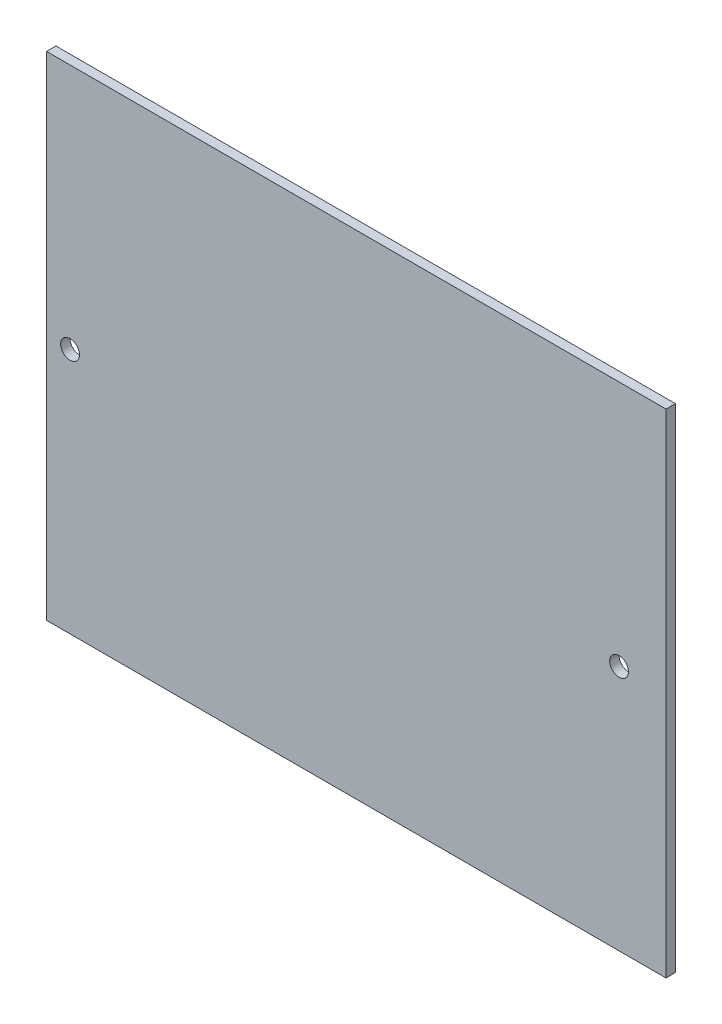
ISO-10303-21;
HEADER;
FILE_DESCRIPTION(('STEP AP214'),'2;1');
FILE_NAME('part.step','',(''),(''),'','','');
FILE_SCHEMA(('AUTOMOTIVE_DESIGN { 1 0 10303 214 1 1 1 1 }'));
ENDSEC;
DATA;
#1=APPLICATION_CONTEXT('core data for automotive mechanical design processes');
#2=APPLICATION_PROTOCOL_DEFINITION('international standard','automotive_design',2000,#1);
#3=PRODUCT_CONTEXT('',#1,'mechanical');
#4=PRODUCT('Part','Part','',(#3));
#5=PRODUCT_RELATED_PRODUCT_CATEGORY('part','',(#4));
#6=PRODUCT_DEFINITION_FORMATION('','',#4);
#7=PRODUCT_DEFINITION_CONTEXT('part definition',#1,'design');
#8=PRODUCT_DEFINITION('design','',#6,#7);
#9=PRODUCT_DEFINITION_SHAPE('','',#8);
#10=(LENGTH_UNIT() NAMED_UNIT(*) SI_UNIT(.MILLI.,.METRE.));
#11=(NAMED_UNIT(*) PLANE_ANGLE_UNIT() SI_UNIT($,.RADIAN.));
#12=(NAMED_UNIT(*) SI_UNIT($,.STERADIAN.) SOLID_ANGLE_UNIT());
#13=UNCERTAINTY_MEASURE_WITH_UNIT(LENGTH_MEASURE(1.E-05),#10,'distance_accuracy_value','');
#14=(GEOMETRIC_REPRESENTATION_CONTEXT(3) GLOBAL_UNCERTAINTY_ASSIGNED_CONTEXT((#13)) GLOBAL_UNIT_ASSIGNED_CONTEXT((#10,
#11,#12)) REPRESENTATION_CONTEXT('',''));
#15=CARTESIAN_POINT('',(0.,0.,0.));
#16=DIRECTION('',(0.,0.,1.));
#17=DIRECTION('',(1.,0.,0.));
#18=AXIS2_PLACEMENT_3D('',#15,#16,#17);
#19=CARTESIAN_POINT('',(206.120120188516,-39.1421064558575,2.));
#20=DIRECTION('',(-1.,0.,0.));
#21=DIRECTION('',(0.,0.,1.));
#22=AXIS2_PLACEMENT_3D('',#19,#20,#21);
#23=PLANE('',#22);
#24=DIRECTION('',(0.,1.,0.));
#25=VECTOR('',#24,1.);
#26=CARTESIAN_POINT('',(206.120120188516,-39.1421064558575,0.));
#27=LINE('',#26,#25);
#28=CARTESIAN_POINT('',(206.120120188516,-39.1421064558575,0.));
#29=VERTEX_POINT('',#28);
#30=CARTESIAN_POINT('',(206.120120188516,65.8578935441425,0.));
#31=VERTEX_POINT('',#30);
#32=EDGE_CURVE('E95',#29,#31,#27,.T.);
#33=ORIENTED_EDGE('',*,*,#32,.T.);
#34=DIRECTION('',(0.,0.,-1.));
#35=VECTOR('',#34,1.);
#36=CARTESIAN_POINT('',(206.120120188516,65.8578935441425,2.));
#37=LINE('',#36,#35);
#38=CARTESIAN_POINT('',(206.120120188516,65.8578935441425,2.));
#39=VERTEX_POINT('',#38);
#40=EDGE_CURVE('E11',#39,#31,#37,.T.);
#41=ORIENTED_EDGE('',*,*,#40,.F.);
#42=DIRECTION('',(0.,1.,0.));
#43=VECTOR('',#42,1.);
#44=CARTESIAN_POINT('',(206.120120188516,-39.1421064558575,2.));
#45=LINE('',#44,#43);
#46=CARTESIAN_POINT('',(206.120120188516,-39.1421064558575,2.));
#47=VERTEX_POINT('',#46);
#48=EDGE_CURVE('E83',#47,#39,#45,.T.);
#49=ORIENTED_EDGE('',*,*,#48,.F.);
#50=DIRECTION('',(0.,0.,-1.));
#51=VECTOR('',#50,1.);
#52=CARTESIAN_POINT('',(206.120120188516,-39.1421064558575,2.));
#53=LINE('',#52,#51);
#54=EDGE_CURVE('E91',#47,#29,#53,.T.);
#55=ORIENTED_EDGE('',*,*,#54,.T.);
#56=EDGE_LOOP('',(#33,#41,#49,#55));
#57=FACE_BOUND('',#56,.T.);
#58=ADVANCED_FACE('F32',(#57),#23,.F.);
#59=CARTESIAN_POINT('',(206.120120188516,65.8578935441425,2.));
#60=DIRECTION('',(0.,-1.,0.));
#61=DIRECTION('',(1.,0.,0.));
#62=AXIS2_PLACEMENT_3D('',#59,#60,#61);
#63=PLANE('',#62);
#64=DIRECTION('',(-1.,0.,0.));
#65=VECTOR('',#64,1.);
#66=CARTESIAN_POINT('',(206.120120188516,65.8578935441425,0.));
#67=LINE('',#66,#65);
#68=CARTESIAN_POINT('',(74.1201201885163,65.8578935441425,0.));
#69=VERTEX_POINT('',#68);
#70=EDGE_CURVE('E87',#31,#69,#67,.T.);
#71=ORIENTED_EDGE('',*,*,#70,.T.);
#72=DIRECTION('',(0.,0.,-1.));
#73=VECTOR('',#72,1.);
#74=CARTESIAN_POINT('',(74.1201201885163,65.8578935441425,2.));
#75=LINE('',#74,#73);
#76=CARTESIAN_POINT('',(74.1201201885163,65.8578935441425,2.));
#77=VERTEX_POINT('',#76);
#78=EDGE_CURVE('E40',#77,#69,#75,.T.);
#79=ORIENTED_EDGE('',*,*,#78,.F.);
#80=DIRECTION('',(-1.,0.,0.));
#81=VECTOR('',#80,1.);
#82=CARTESIAN_POINT('',(206.120120188516,65.8578935441425,2.));
#83=LINE('',#82,#81);
#84=EDGE_CURVE('E78',#39,#77,#83,.T.);
#85=ORIENTED_EDGE('',*,*,#84,.F.);
#86=ORIENTED_EDGE('',*,*,#40,.T.);
#87=EDGE_LOOP('',(#71,#79,#85,#86));
#88=FACE_BOUND('',#87,.T.);
#89=ADVANCED_FACE('F86',(#88),#63,.F.);
#90=CARTESIAN_POINT('',(74.1201201885163,65.8578935441425,2.));
#91=DIRECTION('',(1.,0.,0.));
#92=DIRECTION('',(0.,0.,-1.));
#93=AXIS2_PLACEMENT_3D('',#90,#91,#92);
#94=PLANE('',#93);
#95=DIRECTION('',(0.,-1.,0.));
#96=VECTOR('',#95,1.);
#97=CARTESIAN_POINT('',(74.1201201885163,65.8578935441425,0.));
#98=LINE('',#97,#96);
#99=CARTESIAN_POINT('',(74.1201201885163,-39.1421064558575,0.));
#100=VERTEX_POINT('',#99);
#101=EDGE_CURVE('E65',#69,#100,#98,.T.);
#102=ORIENTED_EDGE('',*,*,#101,.T.);
#103=DIRECTION('',(0.,0.,-1.));
#104=VECTOR('',#103,1.);
#105=CARTESIAN_POINT('',(74.1201201885163,-39.1421064558575,2.));
#106=LINE('',#105,#104);
#107=CARTESIAN_POINT('',(74.1201201885163,-39.1421064558575,2.));
#108=VERTEX_POINT('',#107);
#109=EDGE_CURVE('E88',#108,#100,#106,.T.);
#110=ORIENTED_EDGE('',*,*,#109,.F.);
#111=DIRECTION('',(0.,-1.,0.));
#112=VECTOR('',#111,1.);
#113=CARTESIAN_POINT('',(74.1201201885163,65.8578935441425,2.));
#114=LINE('',#113,#112);
#115=EDGE_CURVE('E81',#77,#108,#114,.T.);
#116=ORIENTED_EDGE('',*,*,#115,.F.);
#117=ORIENTED_EDGE('',*,*,#78,.T.);
#118=EDGE_LOOP('',(#102,#110,#116,#117));
#119=FACE_BOUND('',#118,.T.);
#120=ADVANCED_FACE('F89',(#119),#94,.F.);
#121=CARTESIAN_POINT('',(74.1201201885163,-39.1421064558575,2.));
#122=DIRECTION('',(0.,1.,0.));
#123=DIRECTION('',(-1.,0.,0.));
#124=AXIS2_PLACEMENT_3D('',#121,#122,#123);
#125=PLANE('',#124);
#126=DIRECTION('',(1.,0.,0.));
#127=VECTOR('',#126,1.);
#128=CARTESIAN_POINT('',(74.1201201885163,-39.1421064558575,0.));
#129=LINE('',#128,#127);
#130=EDGE_CURVE('E71',#100,#29,#129,.T.);
#131=ORIENTED_EDGE('',*,*,#130,.T.);
#132=ORIENTED_EDGE('',*,*,#54,.F.);
#133=DIRECTION('',(1.,0.,0.));
#134=VECTOR('',#133,1.);
#135=CARTESIAN_POINT('',(74.1201201885163,-39.1421064558575,2.));
#136=LINE('',#135,#134);
#137=EDGE_CURVE('E48',#108,#47,#136,.T.);
#138=ORIENTED_EDGE('',*,*,#137,.F.);
#139=ORIENTED_EDGE('',*,*,#109,.T.);
#140=EDGE_LOOP('',(#131,#132,#138,#139));
#141=FACE_BOUND('',#140,.T.);
#142=ADVANCED_FACE('F103',(#141),#125,.F.);
#143=CARTESIAN_POINT('',(0.,0.,2.));
#144=DIRECTION('',(0.,0.,1.));
#145=DIRECTION('',(1.,0.,0.));
#146=AXIS2_PLACEMENT_3D('',#143,#144,#145);
#147=PLANE('',#146);
#148=CARTESIAN_POINT('',(79.1201201885163,13.3578935441425,2.));
#149=DIRECTION('',(0.,0.,1.));
#150=DIRECTION('',(1.,0.,0.));
#151=AXIS2_PLACEMENT_3D('',#148,#149,#150);
#152=CIRCLE('',#151,2.);
#153=CARTESIAN_POINT('',(81.1201201885163,13.3578935441425,2.));
#154=VERTEX_POINT('',#153);
#155=EDGE_CURVE('E114',#154,#154,#152,.T.);
#156=ORIENTED_EDGE('',*,*,#155,.F.);
#157=EDGE_LOOP('',(#156));
#158=FACE_BOUND('',#157,.T.);
#159=CARTESIAN_POINT('',(196.120120188516,13.3578935441425,2.));
#160=DIRECTION('',(0.,0.,1.));
#161=DIRECTION('',(1.,0.,0.));
#162=AXIS2_PLACEMENT_3D('',#159,#160,#161);
#163=CIRCLE('',#162,2.);
#164=CARTESIAN_POINT('',(198.120120188516,13.3578935441425,2.));
#165=VERTEX_POINT('',#164);
#166=EDGE_CURVE('E98',#165,#165,#163,.T.);
#167=ORIENTED_EDGE('',*,*,#166,.F.);
#168=EDGE_LOOP('',(#167));
#169=FACE_BOUND('',#168,.T.);
#170=ORIENTED_EDGE('',*,*,#48,.T.);
#171=ORIENTED_EDGE('',*,*,#84,.T.);
#172=ORIENTED_EDGE('',*,*,#115,.T.);
#173=ORIENTED_EDGE('',*,*,#137,.T.);
#174=EDGE_LOOP('',(#170,#171,#172,#173));
#175=FACE_BOUND('',#174,.T.);
#176=ADVANCED_FACE('F79',(#158,#169,#175),#147,.T.);
#177=CARTESIAN_POINT('',(0.,0.,0.));
#178=DIRECTION('',(0.,0.,1.));
#179=DIRECTION('',(1.,0.,0.));
#180=AXIS2_PLACEMENT_3D('',#177,#178,#179);
#181=PLANE('',#180);
#182=CARTESIAN_POINT('',(79.1201201885163,13.3578935441425,0.));
#183=DIRECTION('',(0.,0.,-1.));
#184=DIRECTION('',(-1.,0.,0.));
#185=AXIS2_PLACEMENT_3D('',#182,#183,#184);
#186=CIRCLE('',#185,2.);
#187=CARTESIAN_POINT('',(77.1201201885163,13.3578935441425,0.));
#188=VERTEX_POINT('',#187);
#189=EDGE_CURVE('E117',#188,#188,#186,.T.);
#190=ORIENTED_EDGE('',*,*,#189,.F.);
#191=EDGE_LOOP('',(#190));
#192=FACE_BOUND('',#191,.T.);
#193=CARTESIAN_POINT('',(196.120120188516,13.3578935441425,0.));
#194=DIRECTION('',(0.,0.,-1.));
#195=DIRECTION('',(-1.,0.,0.));
#196=AXIS2_PLACEMENT_3D('',#193,#194,#195);
#197=CIRCLE('',#196,2.);
#198=CARTESIAN_POINT('',(194.120120188516,13.3578935441425,0.));
#199=VERTEX_POINT('',#198);
#200=EDGE_CURVE('E111',#199,#199,#197,.T.);
#201=ORIENTED_EDGE('',*,*,#200,.F.);
#202=EDGE_LOOP('',(#201));
#203=FACE_BOUND('',#202,.T.);
#204=ORIENTED_EDGE('',*,*,#32,.F.);
#205=ORIENTED_EDGE('',*,*,#130,.F.);
#206=ORIENTED_EDGE('',*,*,#101,.F.);
#207=ORIENTED_EDGE('',*,*,#70,.F.);
#208=EDGE_LOOP('',(#204,#205,#206,#207));
#209=FACE_BOUND('',#208,.T.);
#210=ADVANCED_FACE('F106',(#192,#203,#209),#181,.F.);
#211=CARTESIAN_POINT('',(196.120120188516,13.3578935441425,10.));
#212=DIRECTION('',(0.,0.,-1.));
#213=DIRECTION('',(-1.,0.,0.));
#214=AXIS2_PLACEMENT_3D('',#211,#212,#213);
#215=CYLINDRICAL_SURFACE('',#214,2.);
#216=ORIENTED_EDGE('',*,*,#166,.T.);
#217=EDGE_LOOP('',(#216));
#218=FACE_BOUND('',#217,.T.);
#219=ORIENTED_EDGE('',*,*,#200,.T.);
#220=EDGE_LOOP('',(#219));
#221=FACE_BOUND('',#220,.T.);
#222=ADVANCED_FACE('F125',(#218,#221),#215,.F.);
#223=CARTESIAN_POINT('',(79.1201201885163,13.3578935441425,10.));
#224=DIRECTION('',(0.,0.,-1.));
#225=DIRECTION('',(-1.,0.,0.));
#226=AXIS2_PLACEMENT_3D('',#223,#224,#225);
#227=CYLINDRICAL_SURFACE('',#226,2.);
#228=ORIENTED_EDGE('',*,*,#155,.T.);
#229=EDGE_LOOP('',(#228));
#230=FACE_BOUND('',#229,.T.);
#231=ORIENTED_EDGE('',*,*,#189,.T.);
#232=EDGE_LOOP('',(#231));
#233=FACE_BOUND('',#232,.T.);
#234=ADVANCED_FACE('F121',(#230,#233),#227,.F.);
#235=CLOSED_SHELL('',(#58,#89,#120,#142,#176,#210,#222,#234));
#236=MANIFOLD_SOLID_BREP('B2',#235);
#237=ADVANCED_BREP_SHAPE_REPRESENTATION('',(#18,#236),#14);
#238=SHAPE_DEFINITION_REPRESENTATION(#9,#237);
ENDSEC;
END-ISO-10303-21;
